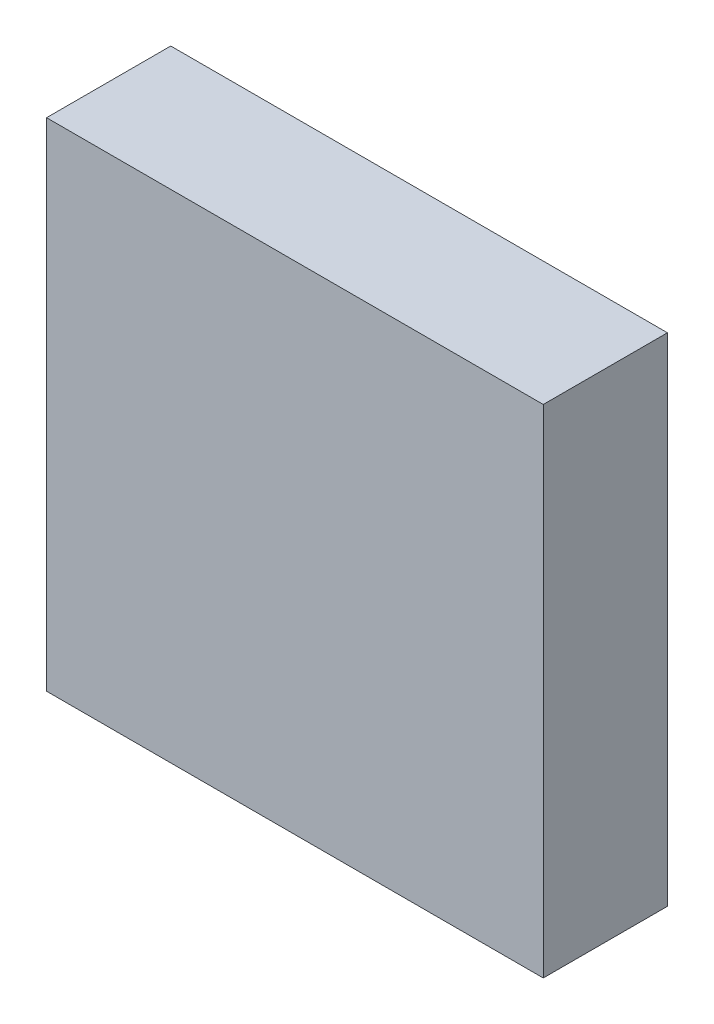
ISO-10303-21;
HEADER;
FILE_DESCRIPTION(('STEP AP214'),'2;1');
FILE_NAME('part.step','',(''),(''),'','','');
FILE_SCHEMA(('AUTOMOTIVE_DESIGN { 1 0 10303 214 1 1 1 1 }'));
ENDSEC;
DATA;
#1=APPLICATION_CONTEXT('core data for automotive mechanical design processes');
#2=APPLICATION_PROTOCOL_DEFINITION('international standard','automotive_design',2000,#1);
#3=PRODUCT_CONTEXT('',#1,'mechanical');
#4=PRODUCT('Part','Part','',(#3));
#5=PRODUCT_RELATED_PRODUCT_CATEGORY('part','',(#4));
#6=PRODUCT_DEFINITION_FORMATION('','',#4);
#7=PRODUCT_DEFINITION_CONTEXT('part definition',#1,'design');
#8=PRODUCT_DEFINITION('design','',#6,#7);
#9=PRODUCT_DEFINITION_SHAPE('','',#8);
#10=(LENGTH_UNIT() NAMED_UNIT(*) SI_UNIT(.MILLI.,.METRE.));
#11=(NAMED_UNIT(*) PLANE_ANGLE_UNIT() SI_UNIT($,.RADIAN.));
#12=(NAMED_UNIT(*) SI_UNIT($,.STERADIAN.) SOLID_ANGLE_UNIT());
#13=UNCERTAINTY_MEASURE_WITH_UNIT(LENGTH_MEASURE(1.E-05),#10,'distance_accuracy_value','');
#14=(GEOMETRIC_REPRESENTATION_CONTEXT(3) GLOBAL_UNCERTAINTY_ASSIGNED_CONTEXT((#13)) GLOBAL_UNIT_ASSIGNED_CONTEXT((#10,
#11,#12)) REPRESENTATION_CONTEXT('',''));
#15=CARTESIAN_POINT('',(0.,0.,0.));
#16=DIRECTION('',(0.,0.,1.));
#17=DIRECTION('',(1.,0.,0.));
#18=AXIS2_PLACEMENT_3D('',#15,#16,#17);
#19=CARTESIAN_POINT('',(-0.4,0.400000000000029,0.2));
#20=DIRECTION('',(0.,0.,1.));
#21=DIRECTION('',(1.,0.,0.));
#22=AXIS2_PLACEMENT_3D('',#19,#20,#21);
#23=PLANE('',#22);
#24=DIRECTION('',(0.,1.,0.));
#25=VECTOR('',#24,1.);
#26=CARTESIAN_POINT('',(-0.400000000000002,-0.399999999999932,0.2));
#27=LINE('',#26,#25);
#28=CARTESIAN_POINT('',(-0.400000000000002,-0.399999999999932,0.2));
#29=VERTEX_POINT('',#28);
#30=CARTESIAN_POINT('',(-0.4,0.400000000000029,0.2));
#31=VERTEX_POINT('',#30);
#32=EDGE_CURVE('E55',#29,#31,#27,.T.);
#33=ORIENTED_EDGE('',*,*,#32,.F.);
#34=DIRECTION('',(1.,0.,0.));
#35=VECTOR('',#34,1.);
#36=CARTESIAN_POINT('',(0.400000000000008,-0.399999999999998,0.2));
#37=LINE('',#36,#35);
#38=CARTESIAN_POINT('',(0.400000000000008,-0.399999999999998,0.2));
#39=VERTEX_POINT('',#38);
#40=EDGE_CURVE('E76',#39,#29,#37,.F.);
#41=ORIENTED_EDGE('',*,*,#40,.F.);
#42=DIRECTION('',(0.,1.,0.));
#43=VECTOR('',#42,1.);
#44=CARTESIAN_POINT('',(0.400000000000009,0.400000000000001,0.2));
#45=LINE('',#44,#43);
#46=CARTESIAN_POINT('',(0.400000000000009,0.400000000000001,0.2));
#47=VERTEX_POINT('',#46);
#48=EDGE_CURVE('E58',#47,#39,#45,.F.);
#49=ORIENTED_EDGE('',*,*,#48,.F.);
#50=DIRECTION('',(1.,0.,0.));
#51=VECTOR('',#50,1.);
#52=CARTESIAN_POINT('',(-0.4,0.400000000000029,0.2));
#53=LINE('',#52,#51);
#54=EDGE_CURVE('E20',#31,#47,#53,.T.);
#55=ORIENTED_EDGE('',*,*,#54,.F.);
#56=EDGE_LOOP('',(#33,#41,#49,#55));
#57=FACE_BOUND('',#56,.T.);
#58=ADVANCED_FACE('F17',(#57),#23,.T.);
#59=CARTESIAN_POINT('',(-0.4,0.400000000000029,0.));
#60=DIRECTION('',(0.,1.,0.));
#61=DIRECTION('',(0.,0.,1.));
#62=AXIS2_PLACEMENT_3D('',#59,#60,#61);
#63=PLANE('',#62);
#64=DIRECTION('',(0.,0.,1.));
#65=VECTOR('',#64,1.);
#66=CARTESIAN_POINT('',(-0.4,0.400000000000029,0.));
#67=LINE('',#66,#65);
#68=CARTESIAN_POINT('',(-0.4,0.400000000000029,0.));
#69=VERTEX_POINT('',#68);
#70=EDGE_CURVE('E63',#31,#69,#67,.F.);
#71=ORIENTED_EDGE('',*,*,#70,.F.);
#72=ORIENTED_EDGE('',*,*,#54,.T.);
#73=DIRECTION('',(0.,0.,-1.));
#74=VECTOR('',#73,1.);
#75=CARTESIAN_POINT('',(0.400000000000009,0.400000000000001,0.));
#76=LINE('',#75,#74);
#77=CARTESIAN_POINT('',(0.400000000000009,0.400000000000001,0.));
#78=VERTEX_POINT('',#77);
#79=EDGE_CURVE('E79',#78,#47,#76,.F.);
#80=ORIENTED_EDGE('',*,*,#79,.F.);
#81=DIRECTION('',(1.,0.,0.));
#82=VECTOR('',#81,1.);
#83=CARTESIAN_POINT('',(-0.4,0.400000000000029,0.));
#84=LINE('',#83,#82);
#85=EDGE_CURVE('E73',#78,#69,#84,.F.);
#86=ORIENTED_EDGE('',*,*,#85,.T.);
#87=EDGE_LOOP('',(#71,#72,#80,#86));
#88=FACE_BOUND('',#87,.T.);
#89=ADVANCED_FACE('F72',(#88),#63,.T.);
#90=CARTESIAN_POINT('',(-0.400000000000002,-0.399999999999932,0.));
#91=DIRECTION('',(-1.,0.,0.));
#92=DIRECTION('',(0.,0.,1.));
#93=AXIS2_PLACEMENT_3D('',#90,#91,#92);
#94=PLANE('',#93);
#95=DIRECTION('',(0.,0.,-1.));
#96=VECTOR('',#95,1.);
#97=CARTESIAN_POINT('',(-0.400000000000002,-0.399999999999932,0.));
#98=LINE('',#97,#96);
#99=CARTESIAN_POINT('',(-0.400000000000002,-0.399999999999932,0.));
#100=VERTEX_POINT('',#99);
#101=EDGE_CURVE('E69',#29,#100,#98,.T.);
#102=ORIENTED_EDGE('',*,*,#101,.F.);
#103=ORIENTED_EDGE('',*,*,#32,.T.);
#104=ORIENTED_EDGE('',*,*,#70,.T.);
#105=DIRECTION('',(0.,1.,0.));
#106=VECTOR('',#105,1.);
#107=CARTESIAN_POINT('',(-0.4,0.400000000000029,0.));
#108=LINE('',#107,#106);
#109=EDGE_CURVE('E83',#69,#100,#108,.F.);
#110=ORIENTED_EDGE('',*,*,#109,.T.);
#111=EDGE_LOOP('',(#102,#103,#104,#110));
#112=FACE_BOUND('',#111,.T.);
#113=ADVANCED_FACE('F66',(#112),#94,.T.);
#114=CARTESIAN_POINT('',(0.400000000000008,-0.399999999999998,0.));
#115=DIRECTION('',(0.,-1.,0.));
#116=DIRECTION('',(0.,0.,-1.));
#117=AXIS2_PLACEMENT_3D('',#114,#115,#116);
#118=PLANE('',#117);
#119=DIRECTION('',(0.,0.,-1.));
#120=VECTOR('',#119,1.);
#121=CARTESIAN_POINT('',(0.400000000000008,-0.399999999999998,0.));
#122=LINE('',#121,#120);
#123=CARTESIAN_POINT('',(0.400000000000008,-0.399999999999998,0.));
#124=VERTEX_POINT('',#123);
#125=EDGE_CURVE('E34',#39,#124,#122,.T.);
#126=ORIENTED_EDGE('',*,*,#125,.F.);
#127=ORIENTED_EDGE('',*,*,#40,.T.);
#128=ORIENTED_EDGE('',*,*,#101,.T.);
#129=DIRECTION('',(1.,0.,0.));
#130=VECTOR('',#129,1.);
#131=CARTESIAN_POINT('',(-0.400000000000002,-0.399999999999932,0.));
#132=LINE('',#131,#130);
#133=EDGE_CURVE('E26',#100,#124,#132,.T.);
#134=ORIENTED_EDGE('',*,*,#133,.T.);
#135=EDGE_LOOP('',(#126,#127,#128,#134));
#136=FACE_BOUND('',#135,.T.);
#137=ADVANCED_FACE('F88',(#136),#118,.T.);
#138=CARTESIAN_POINT('',(0.400000000000009,0.400000000000001,0.));
#139=DIRECTION('',(1.,0.,0.));
#140=DIRECTION('',(0.,0.,-1.));
#141=AXIS2_PLACEMENT_3D('',#138,#139,#140);
#142=PLANE('',#141);
#143=ORIENTED_EDGE('',*,*,#79,.T.);
#144=ORIENTED_EDGE('',*,*,#48,.T.);
#145=ORIENTED_EDGE('',*,*,#125,.T.);
#146=DIRECTION('',(0.,1.,0.));
#147=VECTOR('',#146,1.);
#148=CARTESIAN_POINT('',(0.400000000000009,0.400000000000001,0.));
#149=LINE('',#148,#147);
#150=EDGE_CURVE('E11',#124,#78,#149,.T.);
#151=ORIENTED_EDGE('',*,*,#150,.T.);
#152=EDGE_LOOP('',(#143,#144,#145,#151));
#153=FACE_BOUND('',#152,.T.);
#154=ADVANCED_FACE('F91',(#153),#142,.T.);
#155=CARTESIAN_POINT('',(-0.4,0.400000000000029,0.));
#156=DIRECTION('',(0.,0.,1.));
#157=DIRECTION('',(1.,0.,0.));
#158=AXIS2_PLACEMENT_3D('',#155,#156,#157);
#159=PLANE('',#158);
#160=ORIENTED_EDGE('',*,*,#133,.F.);
#161=ORIENTED_EDGE('',*,*,#109,.F.);
#162=ORIENTED_EDGE('',*,*,#85,.F.);
#163=ORIENTED_EDGE('',*,*,#150,.F.);
#164=EDGE_LOOP('',(#160,#161,#162,#163));
#165=FACE_BOUND('',#164,.T.);
#166=ADVANCED_FACE('F90',(#165),#159,.F.);
#167=CLOSED_SHELL('',(#58,#89,#113,#137,#154,#166));
#168=MANIFOLD_SOLID_BREP('B1',#167);
#169=ADVANCED_BREP_SHAPE_REPRESENTATION('',(#18,#168),#14);
#170=SHAPE_DEFINITION_REPRESENTATION(#9,#169);
ENDSEC;
END-ISO-10303-21;
